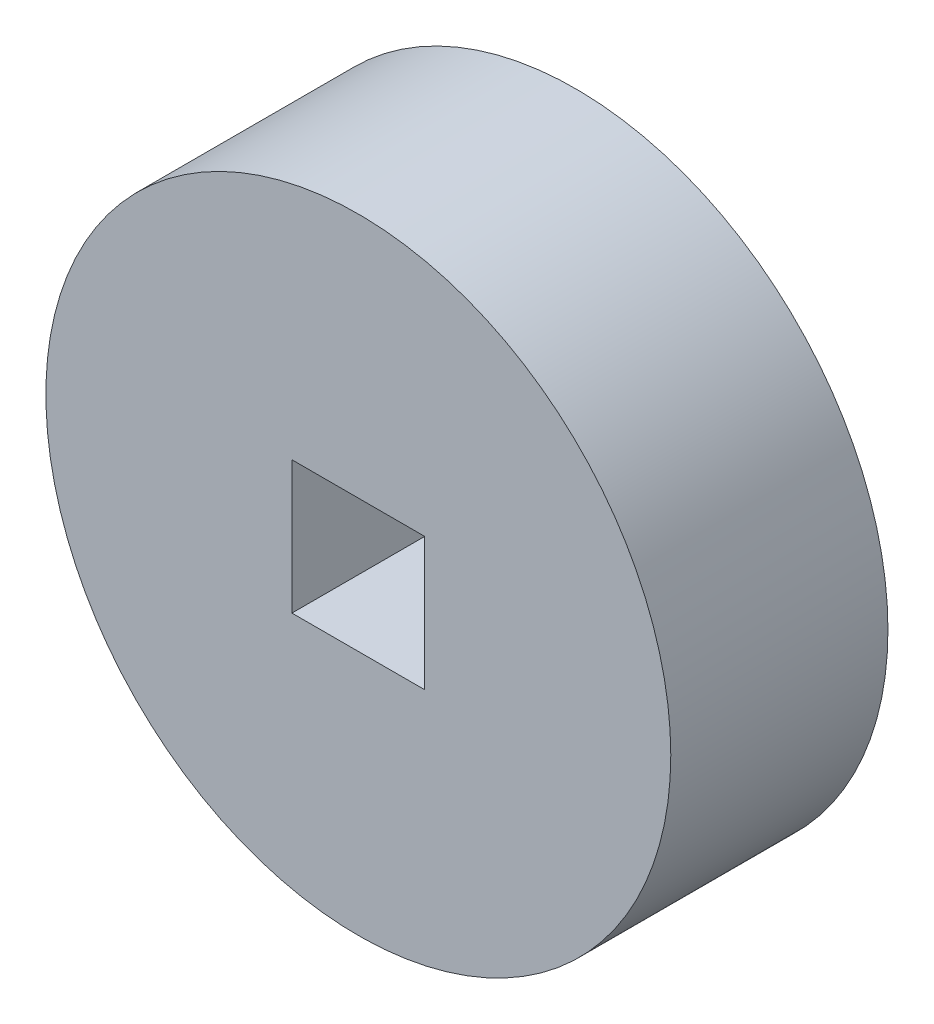
ISO-10303-21;
HEADER;
FILE_DESCRIPTION(('STEP AP214'),'2;1');
FILE_NAME('part.step','',(''),(''),'','','');
FILE_SCHEMA(('AUTOMOTIVE_DESIGN { 1 0 10303 214 1 1 1 1 }'));
ENDSEC;
DATA;
#1=APPLICATION_CONTEXT('core data for automotive mechanical design processes');
#2=APPLICATION_PROTOCOL_DEFINITION('international standard','automotive_design',2000,#1);
#3=PRODUCT_CONTEXT('',#1,'mechanical');
#4=PRODUCT('Part','Part','',(#3));
#5=PRODUCT_RELATED_PRODUCT_CATEGORY('part','',(#4));
#6=PRODUCT_DEFINITION_FORMATION('','',#4);
#7=PRODUCT_DEFINITION_CONTEXT('part definition',#1,'design');
#8=PRODUCT_DEFINITION('design','',#6,#7);
#9=PRODUCT_DEFINITION_SHAPE('','',#8);
#10=(LENGTH_UNIT() NAMED_UNIT(*) SI_UNIT(.MILLI.,.METRE.));
#11=(NAMED_UNIT(*) PLANE_ANGLE_UNIT() SI_UNIT($,.RADIAN.));
#12=(NAMED_UNIT(*) SI_UNIT($,.STERADIAN.) SOLID_ANGLE_UNIT());
#13=UNCERTAINTY_MEASURE_WITH_UNIT(LENGTH_MEASURE(1.E-05),#10,'distance_accuracy_value','');
#14=(GEOMETRIC_REPRESENTATION_CONTEXT(3) GLOBAL_UNCERTAINTY_ASSIGNED_CONTEXT((#13)) GLOBAL_UNIT_ASSIGNED_CONTEXT((#10,
#11,#12)) REPRESENTATION_CONTEXT('',''));
#15=CARTESIAN_POINT('',(0.,0.,0.));
#16=DIRECTION('',(0.,0.,1.));
#17=DIRECTION('',(1.,0.,0.));
#18=AXIS2_PLACEMENT_3D('',#15,#16,#17);
#19=CARTESIAN_POINT('',(0.,0.,8.));
#20=DIRECTION('',(0.,0.,1.));
#21=DIRECTION('',(1.,0.,0.));
#22=AXIS2_PLACEMENT_3D('',#19,#20,#21);
#23=PLANE('',#22);
#24=CARTESIAN_POINT('',(0.,0.,8.));
#25=DIRECTION('',(0.,0.,1.));
#26=DIRECTION('',(1.,0.,0.));
#27=AXIS2_PLACEMENT_3D('',#24,#25,#26);
#28=CIRCLE('',#27,12.);
#29=CARTESIAN_POINT('',(12.,0.,8.));
#30=VERTEX_POINT('',#29);
#31=EDGE_CURVE('E43',#30,#30,#28,.T.);
#32=ORIENTED_EDGE('',*,*,#31,.T.);
#33=EDGE_LOOP('',(#32));
#34=FACE_BOUND('',#33,.T.);
#35=DIRECTION('',(-1.,0.,0.));
#36=VECTOR('',#35,1.);
#37=CARTESIAN_POINT('',(-2.55,2.55,8.));
#38=LINE('',#37,#36);
#39=CARTESIAN_POINT('',(2.55,2.55,8.));
#40=VERTEX_POINT('',#39);
#41=CARTESIAN_POINT('',(-2.55,2.55,8.));
#42=VERTEX_POINT('',#41);
#43=EDGE_CURVE('E94',#40,#42,#38,.T.);
#44=ORIENTED_EDGE('',*,*,#43,.F.);
#45=DIRECTION('',(0.,1.,0.));
#46=VECTOR('',#45,1.);
#47=CARTESIAN_POINT('',(2.55,-2.55,8.));
#48=LINE('',#47,#46);
#49=CARTESIAN_POINT('',(2.55,-2.55,8.));
#50=VERTEX_POINT('',#49);
#51=EDGE_CURVE('E85',#50,#40,#48,.T.);
#52=ORIENTED_EDGE('',*,*,#51,.F.);
#53=DIRECTION('',(1.,0.,0.));
#54=VECTOR('',#53,1.);
#55=CARTESIAN_POINT('',(-2.55,-2.55,8.));
#56=LINE('',#55,#54);
#57=CARTESIAN_POINT('',(-2.55,-2.55,8.));
#58=VERTEX_POINT('',#57);
#59=EDGE_CURVE('E61',#58,#50,#56,.T.);
#60=ORIENTED_EDGE('',*,*,#59,.F.);
#61=DIRECTION('',(0.,-1.,0.));
#62=VECTOR('',#61,1.);
#63=CARTESIAN_POINT('',(-2.55,-2.55,8.));
#64=LINE('',#63,#62);
#65=EDGE_CURVE('E105',#42,#58,#64,.T.);
#66=ORIENTED_EDGE('',*,*,#65,.F.);
#67=EDGE_LOOP('',(#44,#52,#60,#66));
#68=FACE_BOUND('',#67,.T.);
#69=ADVANCED_FACE('F39',(#34,#68),#23,.T.);
#70=CARTESIAN_POINT('',(0.,0.,-0.34));
#71=DIRECTION('',(0.,0.,1.));
#72=DIRECTION('',(1.,0.,0.));
#73=AXIS2_PLACEMENT_3D('',#70,#71,#72);
#74=CYLINDRICAL_SURFACE('',#73,12.);
#75=CARTESIAN_POINT('',(0.,0.,-0.34));
#76=DIRECTION('',(0.,0.,1.));
#77=DIRECTION('',(1.,0.,0.));
#78=AXIS2_PLACEMENT_3D('',#75,#76,#77);
#79=CIRCLE('',#78,12.);
#80=CARTESIAN_POINT('',(12.,0.,-0.34));
#81=VERTEX_POINT('',#80);
#82=EDGE_CURVE('E11',#81,#81,#79,.T.);
#83=ORIENTED_EDGE('',*,*,#82,.T.);
#84=EDGE_LOOP('',(#83));
#85=FACE_BOUND('',#84,.T.);
#86=ORIENTED_EDGE('',*,*,#31,.F.);
#87=EDGE_LOOP('',(#86));
#88=FACE_BOUND('',#87,.T.);
#89=ADVANCED_FACE('F41',(#85,#88),#74,.T.);
#90=CARTESIAN_POINT('',(0.,0.,-0.34));
#91=DIRECTION('',(0.,0.,1.));
#92=DIRECTION('',(1.,0.,0.));
#93=AXIS2_PLACEMENT_3D('',#90,#91,#92);
#94=PLANE('',#93);
#95=ORIENTED_EDGE('',*,*,#82,.F.);
#96=EDGE_LOOP('',(#95));
#97=FACE_BOUND('',#96,.T.);
#98=ADVANCED_FACE('F144',(#97),#94,.F.);
#99=CARTESIAN_POINT('',(2.55,-2.55,8.));
#100=DIRECTION('',(-1.,0.,0.));
#101=DIRECTION('',(0.,0.,1.));
#102=AXIS2_PLACEMENT_3D('',#99,#100,#101);
#103=PLANE('',#102);
#104=DIRECTION('',(0.,1.,0.));
#105=VECTOR('',#104,1.);
#106=CARTESIAN_POINT('',(2.55,-2.55,0.));
#107=LINE('',#106,#105);
#108=CARTESIAN_POINT('',(2.55,-2.55,0.));
#109=VERTEX_POINT('',#108);
#110=CARTESIAN_POINT('',(2.55,2.55,0.));
#111=VERTEX_POINT('',#110);
#112=EDGE_CURVE('E113',#109,#111,#107,.T.);
#113=ORIENTED_EDGE('',*,*,#112,.F.);
#114=DIRECTION('',(0.,0.,-1.));
#115=VECTOR('',#114,1.);
#116=CARTESIAN_POINT('',(2.55,-2.55,8.));
#117=LINE('',#116,#115);
#118=EDGE_CURVE('E90',#50,#109,#117,.T.);
#119=ORIENTED_EDGE('',*,*,#118,.F.);
#120=ORIENTED_EDGE('',*,*,#51,.T.);
#121=DIRECTION('',(0.,0.,-1.));
#122=VECTOR('',#121,1.);
#123=CARTESIAN_POINT('',(2.55,2.55,8.));
#124=LINE('',#123,#122);
#125=EDGE_CURVE('E89',#40,#111,#124,.T.);
#126=ORIENTED_EDGE('',*,*,#125,.T.);
#127=EDGE_LOOP('',(#113,#119,#120,#126));
#128=FACE_BOUND('',#127,.T.);
#129=ADVANCED_FACE('F88',(#128),#103,.T.);
#130=CARTESIAN_POINT('',(-2.55,2.55,8.));
#131=DIRECTION('',(0.,-1.,0.));
#132=DIRECTION('',(0.,0.,-1.));
#133=AXIS2_PLACEMENT_3D('',#130,#131,#132);
#134=PLANE('',#133);
#135=DIRECTION('',(-1.,0.,0.));
#136=VECTOR('',#135,1.);
#137=CARTESIAN_POINT('',(-2.55,2.55,0.));
#138=LINE('',#137,#136);
#139=CARTESIAN_POINT('',(-2.55,2.55,0.));
#140=VERTEX_POINT('',#139);
#141=EDGE_CURVE('E100',#111,#140,#138,.T.);
#142=ORIENTED_EDGE('',*,*,#141,.F.);
#143=ORIENTED_EDGE('',*,*,#125,.F.);
#144=ORIENTED_EDGE('',*,*,#43,.T.);
#145=DIRECTION('',(0.,0.,-1.));
#146=VECTOR('',#145,1.);
#147=CARTESIAN_POINT('',(-2.55,2.55,8.));
#148=LINE('',#147,#146);
#149=EDGE_CURVE('E102',#42,#140,#148,.T.);
#150=ORIENTED_EDGE('',*,*,#149,.T.);
#151=EDGE_LOOP('',(#142,#143,#144,#150));
#152=FACE_BOUND('',#151,.T.);
#153=ADVANCED_FACE('F97',(#152),#134,.T.);
#154=CARTESIAN_POINT('',(-2.55,-2.55,8.));
#155=DIRECTION('',(1.,0.,0.));
#156=DIRECTION('',(0.,0.,-1.));
#157=AXIS2_PLACEMENT_3D('',#154,#155,#156);
#158=PLANE('',#157);
#159=DIRECTION('',(0.,-1.,0.));
#160=VECTOR('',#159,1.);
#161=CARTESIAN_POINT('',(-2.55,-2.55,0.));
#162=LINE('',#161,#160);
#163=CARTESIAN_POINT('',(-2.55,-2.55,0.));
#164=VERTEX_POINT('',#163);
#165=EDGE_CURVE('E118',#140,#164,#162,.T.);
#166=ORIENTED_EDGE('',*,*,#165,.F.);
#167=ORIENTED_EDGE('',*,*,#149,.F.);
#168=ORIENTED_EDGE('',*,*,#65,.T.);
#169=DIRECTION('',(0.,0.,-1.));
#170=VECTOR('',#169,1.);
#171=CARTESIAN_POINT('',(-2.55,-2.55,8.));
#172=LINE('',#171,#170);
#173=EDGE_CURVE('E55',#58,#164,#172,.T.);
#174=ORIENTED_EDGE('',*,*,#173,.T.);
#175=EDGE_LOOP('',(#166,#167,#168,#174));
#176=FACE_BOUND('',#175,.T.);
#177=ADVANCED_FACE('F130',(#176),#158,.T.);
#178=CARTESIAN_POINT('',(-2.55,-2.55,8.));
#179=DIRECTION('',(0.,1.,0.));
#180=DIRECTION('',(0.,0.,1.));
#181=AXIS2_PLACEMENT_3D('',#178,#179,#180);
#182=PLANE('',#181);
#183=DIRECTION('',(1.,0.,0.));
#184=VECTOR('',#183,1.);
#185=CARTESIAN_POINT('',(-2.55,-2.55,0.));
#186=LINE('',#185,#184);
#187=EDGE_CURVE('E80',#164,#109,#186,.T.);
#188=ORIENTED_EDGE('',*,*,#187,.F.);
#189=ORIENTED_EDGE('',*,*,#173,.F.);
#190=ORIENTED_EDGE('',*,*,#59,.T.);
#191=ORIENTED_EDGE('',*,*,#118,.T.);
#192=EDGE_LOOP('',(#188,#189,#190,#191));
#193=FACE_BOUND('',#192,.T.);
#194=ADVANCED_FACE('F133',(#193),#182,.T.);
#195=CARTESIAN_POINT('',(0.,0.,0.));
#196=DIRECTION('',(0.,0.,-1.));
#197=DIRECTION('',(-1.,0.,0.));
#198=AXIS2_PLACEMENT_3D('',#195,#196,#197);
#199=PLANE('',#198);
#200=ORIENTED_EDGE('',*,*,#112,.T.);
#201=ORIENTED_EDGE('',*,*,#141,.T.);
#202=ORIENTED_EDGE('',*,*,#165,.T.);
#203=ORIENTED_EDGE('',*,*,#187,.T.);
#204=EDGE_LOOP('',(#200,#201,#202,#203));
#205=FACE_BOUND('',#204,.T.);
#206=ADVANCED_FACE('F131',(#205),#199,.F.);
#207=CLOSED_SHELL('',(#69,#89,#98,#129,#153,#177,#194,#206));
#208=MANIFOLD_SOLID_BREP('B2',#207);
#209=ADVANCED_BREP_SHAPE_REPRESENTATION('',(#18,#208),#14);
#210=SHAPE_DEFINITION_REPRESENTATION(#9,#209);
ENDSEC;
END-ISO-10303-21;
